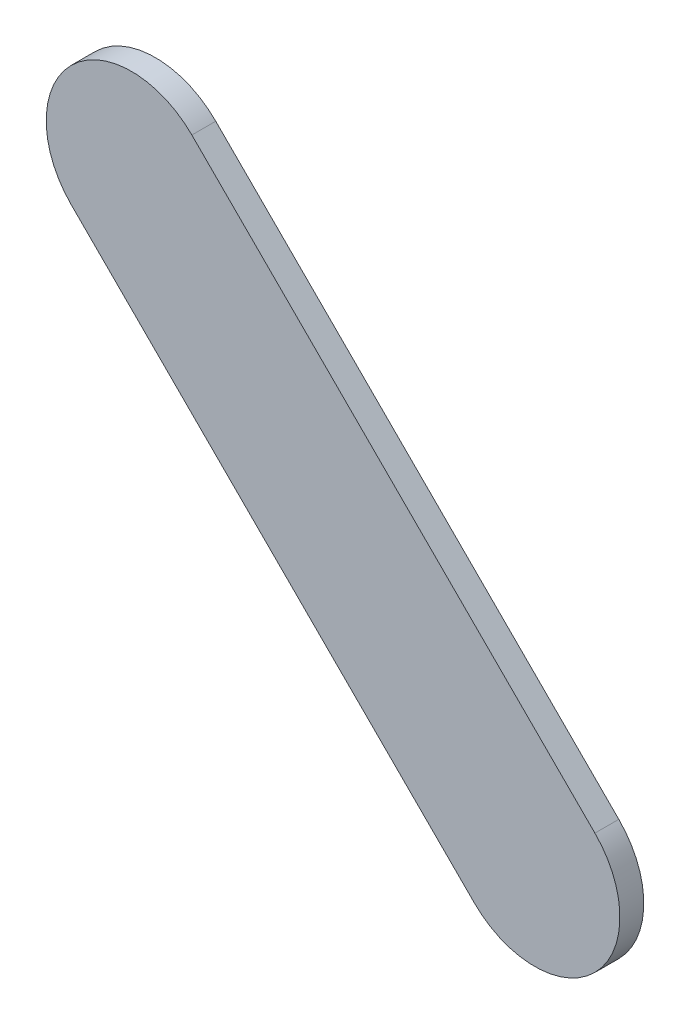
ISO-10303-21;
HEADER;
FILE_DESCRIPTION(('STEP AP214'),'2;1');
FILE_NAME('part.step','',(''),(''),'','','');
FILE_SCHEMA(('AUTOMOTIVE_DESIGN { 1 0 10303 214 1 1 1 1 }'));
ENDSEC;
DATA;
#1=APPLICATION_CONTEXT('core data for automotive mechanical design processes');
#2=APPLICATION_PROTOCOL_DEFINITION('international standard','automotive_design',2000,#1);
#3=PRODUCT_CONTEXT('',#1,'mechanical');
#4=PRODUCT('Part','Part','',(#3));
#5=PRODUCT_RELATED_PRODUCT_CATEGORY('part','',(#4));
#6=PRODUCT_DEFINITION_FORMATION('','',#4);
#7=PRODUCT_DEFINITION_CONTEXT('part definition',#1,'design');
#8=PRODUCT_DEFINITION('design','',#6,#7);
#9=PRODUCT_DEFINITION_SHAPE('','',#8);
#10=(LENGTH_UNIT() NAMED_UNIT(*) SI_UNIT(.MILLI.,.METRE.));
#11=(NAMED_UNIT(*) PLANE_ANGLE_UNIT() SI_UNIT($,.RADIAN.));
#12=(NAMED_UNIT(*) SI_UNIT($,.STERADIAN.) SOLID_ANGLE_UNIT());
#13=UNCERTAINTY_MEASURE_WITH_UNIT(LENGTH_MEASURE(1.E-05),#10,'distance_accuracy_value','');
#14=(GEOMETRIC_REPRESENTATION_CONTEXT(3) GLOBAL_UNCERTAINTY_ASSIGNED_CONTEXT((#13)) GLOBAL_UNIT_ASSIGNED_CONTEXT((#10,
#11,#12)) REPRESENTATION_CONTEXT('',''));
#15=CARTESIAN_POINT('',(0.,0.,0.));
#16=DIRECTION('',(0.,0.,1.));
#17=DIRECTION('',(1.,0.,0.));
#18=AXIS2_PLACEMENT_3D('',#15,#16,#17);
#19=CARTESIAN_POINT('',(90.4272131,97.39713058,0.));
#20=DIRECTION('',(0.707106781186539,0.707106781186556,0.));
#21=DIRECTION('',(0.707106781186556,-0.707106781186539,0.));
#22=AXIS2_PLACEMENT_3D('',#19,#20,#21);
#23=PLANE('',#22);
#24=DIRECTION('',(0.707106781186556,-0.707106781186539,0.));
#25=VECTOR('',#24,1.);
#26=CARTESIAN_POINT('',(90.4272131,97.39713058,0.03556));
#27=LINE('',#26,#25);
#28=CARTESIAN_POINT('',(90.4272131,97.39713058,0.03556));
#29=VERTEX_POINT('',#28);
#30=CARTESIAN_POINT('',(91.0271738,96.79716988,0.03556));
#31=VERTEX_POINT('',#30);
#32=EDGE_CURVE('E11',#29,#31,#27,.T.);
#33=ORIENTED_EDGE('',*,*,#32,.F.);
#34=DIRECTION('',(0.,0.,1.));
#35=VECTOR('',#34,1.);
#36=CARTESIAN_POINT('',(90.4272131,97.39713058,0.));
#37=LINE('',#36,#35);
#38=CARTESIAN_POINT('',(90.4272131,97.39713058,0.));
#39=VERTEX_POINT('',#38);
#40=EDGE_CURVE('E24',#39,#29,#37,.T.);
#41=ORIENTED_EDGE('',*,*,#40,.F.);
#42=DIRECTION('',(0.707106781186556,-0.707106781186539,0.));
#43=VECTOR('',#42,1.);
#44=CARTESIAN_POINT('',(90.4272131,97.39713058,0.));
#45=LINE('',#44,#43);
#46=CARTESIAN_POINT('',(91.0271738,96.79716988,0.));
#47=VERTEX_POINT('',#46);
#48=EDGE_CURVE('E75',#39,#47,#45,.T.);
#49=ORIENTED_EDGE('',*,*,#48,.T.);
#50=DIRECTION('',(0.,0.,1.));
#51=VECTOR('',#50,1.);
#52=CARTESIAN_POINT('',(91.0271738,96.79716988,0.));
#53=LINE('',#52,#51);
#54=EDGE_CURVE('E37',#47,#31,#53,.T.);
#55=ORIENTED_EDGE('',*,*,#54,.T.);
#56=EDGE_LOOP('',(#33,#41,#49,#55));
#57=FACE_BOUND('',#56,.T.);
#58=ADVANCED_FACE('F17',(#57),#23,.F.);
#59=CARTESIAN_POINT('',(91.1169755,96.88697285,0.));
#60=DIRECTION('',(0.,0.,-1.));
#61=DIRECTION('',(-0.707101781156281,-0.707111781181459,0.));
#62=AXIS2_PLACEMENT_3D('',#59,#60,#61);
#63=CYLINDRICAL_SURFACE('',#62,0.126999680092946);
#64=CARTESIAN_POINT('',(91.1169755,96.88697285,0.03556));
#65=DIRECTION('',(0.,0.,1.));
#66=DIRECTION('',(-0.707101781156281,-0.707111781181459,0.));
#67=AXIS2_PLACEMENT_3D('',#64,#65,#66);
#68=CIRCLE('',#67,0.126999680092946);
#69=CARTESIAN_POINT('',(91.2067772,96.97677582,0.03556));
#70=VERTEX_POINT('',#69);
#71=EDGE_CURVE('E83',#31,#70,#68,.T.);
#72=ORIENTED_EDGE('',*,*,#71,.F.);
#73=ORIENTED_EDGE('',*,*,#54,.F.);
#74=CARTESIAN_POINT('',(91.1169755,96.88697285,0.));
#75=DIRECTION('',(0.,0.,1.));
#76=DIRECTION('',(-0.707101781156281,-0.707111781181459,0.));
#77=AXIS2_PLACEMENT_3D('',#74,#75,#76);
#78=CIRCLE('',#77,0.126999680092946);
#79=CARTESIAN_POINT('',(91.2067772,96.97677582,0.));
#80=VERTEX_POINT('',#79);
#81=EDGE_CURVE('E81',#47,#80,#78,.T.);
#82=ORIENTED_EDGE('',*,*,#81,.T.);
#83=DIRECTION('',(0.,0.,1.));
#84=VECTOR('',#83,1.);
#85=CARTESIAN_POINT('',(91.2067772,96.97677582,0.));
#86=LINE('',#85,#84);
#87=EDGE_CURVE('E67',#80,#70,#86,.T.);
#88=ORIENTED_EDGE('',*,*,#87,.T.);
#89=EDGE_LOOP('',(#72,#73,#82,#88));
#90=FACE_BOUND('',#89,.T.);
#91=ADVANCED_FACE('F89',(#90),#63,.T.);
#92=CARTESIAN_POINT('',(91.2067772,96.97677582,0.));
#93=DIRECTION('',(-0.707106781186548,-0.707106781186548,0.));
#94=DIRECTION('',(-0.707106781186548,0.707106781186548,0.));
#95=AXIS2_PLACEMENT_3D('',#92,#93,#94);
#96=PLANE('',#95);
#97=DIRECTION('',(-0.707106781186548,0.707106781186548,0.));
#98=VECTOR('',#97,1.);
#99=CARTESIAN_POINT('',(91.2067772,96.97677582,0.03556));
#100=LINE('',#99,#98);
#101=CARTESIAN_POINT('',(90.60681904,97.57673398,0.03556));
#102=VERTEX_POINT('',#101);
#103=EDGE_CURVE('E71',#70,#102,#100,.T.);
#104=ORIENTED_EDGE('',*,*,#103,.F.);
#105=ORIENTED_EDGE('',*,*,#87,.F.);
#106=DIRECTION('',(-0.707106781186548,0.707106781186548,0.));
#107=VECTOR('',#106,1.);
#108=CARTESIAN_POINT('',(91.2067772,96.97677582,0.));
#109=LINE('',#108,#107);
#110=CARTESIAN_POINT('',(90.60681904,97.57673398,0.));
#111=VERTEX_POINT('',#110);
#112=EDGE_CURVE('E63',#80,#111,#109,.T.);
#113=ORIENTED_EDGE('',*,*,#112,.T.);
#114=DIRECTION('',(0.,0.,1.));
#115=VECTOR('',#114,1.);
#116=CARTESIAN_POINT('',(90.60681904,97.57673398,0.));
#117=LINE('',#116,#115);
#118=EDGE_CURVE('E53',#111,#102,#117,.T.);
#119=ORIENTED_EDGE('',*,*,#118,.T.);
#120=EDGE_LOOP('',(#104,#105,#113,#119));
#121=FACE_BOUND('',#120,.T.);
#122=ADVANCED_FACE('F66',(#121),#96,.F.);
#123=CARTESIAN_POINT('',(90.51701607,97.48693228,0.));
#124=DIRECTION('',(0.,0.,-1.));
#125=DIRECTION('',(0.707111781181459,0.707101781156281,0.));
#126=AXIS2_PLACEMENT_3D('',#123,#124,#125);
#127=CYLINDRICAL_SURFACE('',#126,0.126999680092949);
#128=CARTESIAN_POINT('',(90.51701607,97.48693228,0.03556));
#129=DIRECTION('',(0.,0.,1.));
#130=DIRECTION('',(0.707111781181459,0.707101781156281,0.));
#131=AXIS2_PLACEMENT_3D('',#128,#129,#130);
#132=CIRCLE('',#131,0.126999680092949);
#133=EDGE_CURVE('E59',#102,#29,#132,.T.);
#134=ORIENTED_EDGE('',*,*,#133,.F.);
#135=ORIENTED_EDGE('',*,*,#118,.F.);
#136=CARTESIAN_POINT('',(90.51701607,97.48693228,0.));
#137=DIRECTION('',(0.,0.,1.));
#138=DIRECTION('',(0.707111781181459,0.707101781156281,0.));
#139=AXIS2_PLACEMENT_3D('',#136,#137,#138);
#140=CIRCLE('',#139,0.126999680092949);
#141=EDGE_CURVE('E57',#111,#39,#140,.T.);
#142=ORIENTED_EDGE('',*,*,#141,.T.);
#143=ORIENTED_EDGE('',*,*,#40,.T.);
#144=EDGE_LOOP('',(#134,#135,#142,#143));
#145=FACE_BOUND('',#144,.T.);
#146=ADVANCED_FACE('F55',(#145),#127,.T.);
#147=CARTESIAN_POINT('',(90.4272131,97.39713058,0.));
#148=DIRECTION('',(0.,0.,-1.));
#149=DIRECTION('',(-1.,0.,0.));
#150=AXIS2_PLACEMENT_3D('',#147,#148,#149);
#151=PLANE('',#150);
#152=ORIENTED_EDGE('',*,*,#141,.F.);
#153=ORIENTED_EDGE('',*,*,#112,.F.);
#154=ORIENTED_EDGE('',*,*,#81,.F.);
#155=ORIENTED_EDGE('',*,*,#48,.F.);
#156=EDGE_LOOP('',(#152,#153,#154,#155));
#157=FACE_BOUND('',#156,.T.);
#158=ADVANCED_FACE('F74',(#157),#151,.T.);
#159=CARTESIAN_POINT('',(90.4272131,97.39713058,0.03556));
#160=DIRECTION('',(0.,0.,-1.));
#161=DIRECTION('',(-1.,0.,0.));
#162=AXIS2_PLACEMENT_3D('',#159,#160,#161);
#163=PLANE('',#162);
#164=ORIENTED_EDGE('',*,*,#32,.T.);
#165=ORIENTED_EDGE('',*,*,#71,.T.);
#166=ORIENTED_EDGE('',*,*,#103,.T.);
#167=ORIENTED_EDGE('',*,*,#133,.T.);
#168=EDGE_LOOP('',(#164,#165,#166,#167));
#169=FACE_BOUND('',#168,.T.);
#170=ADVANCED_FACE('F91',(#169),#163,.F.);
#171=CLOSED_SHELL('',(#58,#91,#122,#146,#158,#170));
#172=MANIFOLD_SOLID_BREP('B1',#171);
#173=ADVANCED_BREP_SHAPE_REPRESENTATION('',(#18,#172),#14);
#174=SHAPE_DEFINITION_REPRESENTATION(#9,#173);
ENDSEC;
END-ISO-10303-21;
